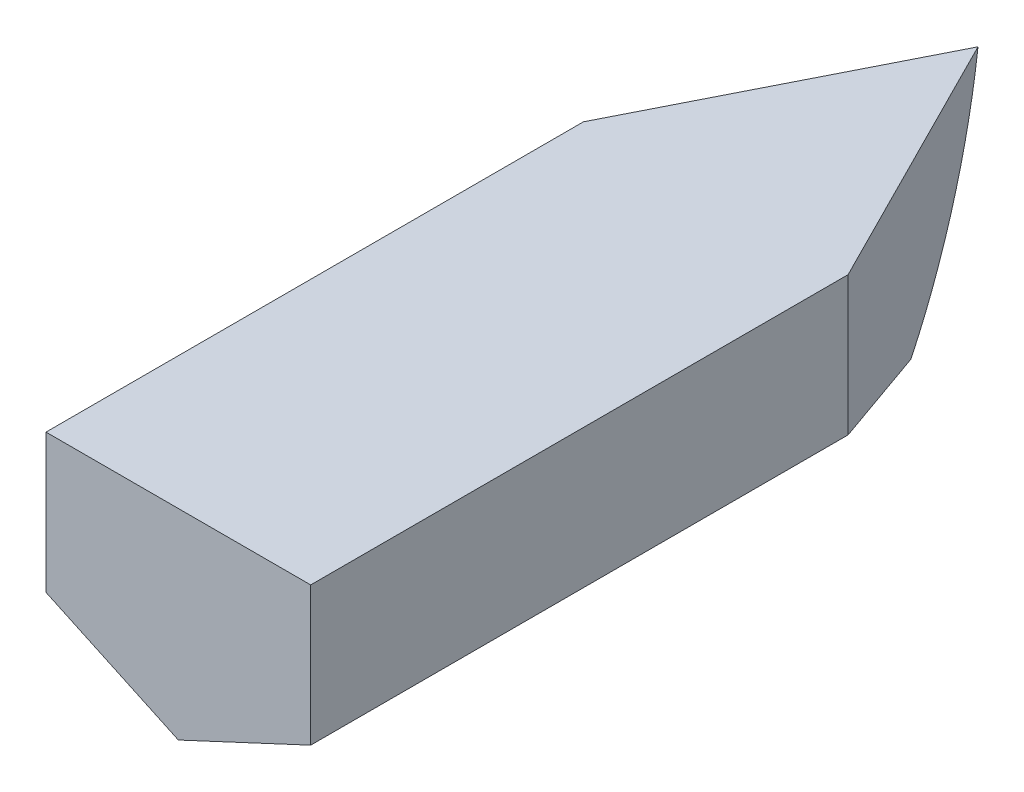
ISO-10303-21;
HEADER;
FILE_DESCRIPTION(('STEP AP214'),'2;1');
FILE_NAME('part.step','',(''),(''),'','','');
FILE_SCHEMA(('AUTOMOTIVE_DESIGN { 1 0 10303 214 1 1 1 1 }'));
ENDSEC;
DATA;
#1=APPLICATION_CONTEXT('core data for automotive mechanical design processes');
#2=APPLICATION_PROTOCOL_DEFINITION('international standard','automotive_design',2000,#1);
#3=PRODUCT_CONTEXT('',#1,'mechanical');
#4=PRODUCT('Part','Part','',(#3));
#5=PRODUCT_RELATED_PRODUCT_CATEGORY('part','',(#4));
#6=PRODUCT_DEFINITION_FORMATION('','',#4);
#7=PRODUCT_DEFINITION_CONTEXT('part definition',#1,'design');
#8=PRODUCT_DEFINITION('design','',#6,#7);
#9=PRODUCT_DEFINITION_SHAPE('','',#8);
#10=(LENGTH_UNIT() NAMED_UNIT(*) SI_UNIT(.MILLI.,.METRE.));
#11=(NAMED_UNIT(*) PLANE_ANGLE_UNIT() SI_UNIT($,.RADIAN.));
#12=(NAMED_UNIT(*) SI_UNIT($,.STERADIAN.) SOLID_ANGLE_UNIT());
#13=UNCERTAINTY_MEASURE_WITH_UNIT(LENGTH_MEASURE(1.E-05),#10,'distance_accuracy_value','');
#14=(GEOMETRIC_REPRESENTATION_CONTEXT(3) GLOBAL_UNCERTAINTY_ASSIGNED_CONTEXT((#13)) GLOBAL_UNIT_ASSIGNED_CONTEXT((#10,
#11,#12)) REPRESENTATION_CONTEXT('',''));
#15=CARTESIAN_POINT('',(0.,0.,0.));
#16=DIRECTION('',(0.,0.,1.));
#17=DIRECTION('',(1.,0.,0.));
#18=AXIS2_PLACEMENT_3D('',#15,#16,#17);
#19=CARTESIAN_POINT('',(0.000236309728793086,-63.0481658964329,-282.275632457786));
#20=DIRECTION('',(-0.892749487223846,0.,-0.450553385362446));
#21=DIRECTION('',(-0.450553385362446,0.,0.892749487223846));
#22=AXIS2_PLACEMENT_3D('',#19,#20,#21);
#23=PLANE('',#22);
#24=DIRECTION('',(-0.440927086659275,0.205607677197189,0.873675447364604));
#25=VECTOR('',#24,1.);
#26=CARTESIAN_POINT('',(-5.51209118767557,-60.4771721556966,-271.353225243469));
#27=LINE('',#26,#25);
#28=CARTESIAN_POINT('',(-38.7653446429146,-44.9709254109497,-205.463530625355));
#29=VERTEX_POINT('',#28);
#30=CARTESIAN_POINT('',(-75.0561484010946,-28.0482456979105,-133.555078711286));
#31=VERTEX_POINT('',#30);
#32=EDGE_CURVE('E150',#29,#31,#27,.T.);
#33=ORIENTED_EDGE('',*,*,#32,.T.);
#34=DIRECTION('',(0.,1.,0.));
#35=VECTOR('',#34,1.);
#36=CARTESIAN_POINT('',(-75.0561484010946,-28.0482456979104,-133.555078711286));
#37=LINE('',#36,#35);
#38=CARTESIAN_POINT('',(-75.0561484010946,50.6719145599895,-133.555078711286));
#39=VERTEX_POINT('',#38);
#40=EDGE_CURVE('E225',#31,#39,#37,.T.);
#41=ORIENTED_EDGE('',*,*,#40,.T.);
#42=DIRECTION('',(-0.450553385362446,0.,0.892749487223846));
#43=VECTOR('',#42,1.);
#44=CARTESIAN_POINT('',(0.000236309728782573,50.6719145599895,-282.275632457786));
#45=LINE('',#44,#43);
#46=CARTESIAN_POINT('',(0.000236309728793086,50.6719145599895,-282.275632457786));
#47=VERTEX_POINT('',#46);
#48=EDGE_CURVE('E457',#47,#39,#45,.T.);
#49=ORIENTED_EDGE('',*,*,#48,.F.);
#50=CARTESIAN_POINT('',(-75.4432099621159,92.0615570355149,-132.788135167297));
#51=DIRECTION('',(-0.892749487223846,0.,-0.450553385362446));
#52=DIRECTION('',(0.450553385362446,0.,-0.892749487223846));
#53=AXIS2_PLACEMENT_3D('',#50,#51,#52);
#54=ELLIPSE('',#53,173.745962585296,155.111619005237);
#55=EDGE_CURVE('E525',#47,#29,#54,.T.);
#56=ORIENTED_EDGE('',*,*,#55,.T.);
#57=EDGE_LOOP('',(#33,#41,#49,#56));
#58=FACE_BOUND('',#57,.T.);
#59=ADVANCED_FACE('F67',(#58),#23,.T.);
#60=CARTESIAN_POINT('',(75.0589937649358,-63.0481658964329,-133.555078711286));
#61=DIRECTION('',(0.892743758101189,0.,-0.45056473715923));
#62=DIRECTION('',(-0.45056473715923,0.,-0.892743758101189));
#63=AXIS2_PLACEMENT_3D('',#60,#61,#62);
#64=PLANE('',#63);
#65=DIRECTION('',(-0.440937726263639,-0.205612638526184,-0.873668910077355));
#66=VECTOR('',#65,1.);
#67=CARTESIAN_POINT('',(5.512930172541,-60.478107745578,-271.352844608525));
#68=LINE('',#67,#66);
#69=CARTESIAN_POINT('',(75.0589937649358,-28.0482456979105,-133.555078711286));
#70=VERTEX_POINT('',#69);
#71=CARTESIAN_POINT('',(38.7673953732541,-44.9712959546369,-205.462831945509));
#72=VERTEX_POINT('',#71);
#73=EDGE_CURVE('E194',#70,#72,#68,.T.);
#74=ORIENTED_EDGE('',*,*,#73,.T.);
#75=CARTESIAN_POINT('',(75.4460675620665,92.0615570355149,-132.788135167297));
#76=DIRECTION('',(0.892743758101189,0.,-0.45056473715923));
#77=DIRECTION('',(0.45056473715923,0.,0.892743758101189));
#78=AXIS2_PLACEMENT_3D('',#75,#76,#77);
#79=ELLIPSE('',#78,173.747077588254,155.111619005237);
#80=EDGE_CURVE('E572',#72,#47,#79,.T.);
#81=ORIENTED_EDGE('',*,*,#80,.T.);
#82=DIRECTION('',(-0.45056473715923,0.,-0.892743758101189));
#83=VECTOR('',#82,1.);
#84=CARTESIAN_POINT('',(75.0589937649358,50.6719145599895,-133.555078711286));
#85=LINE('',#84,#83);
#86=CARTESIAN_POINT('',(75.0589937649358,50.6719145599895,-133.555078711286));
#87=VERTEX_POINT('',#86);
#88=EDGE_CURVE('E224',#87,#47,#85,.T.);
#89=ORIENTED_EDGE('',*,*,#88,.F.);
#90=DIRECTION('',(0.,-1.,0.));
#91=VECTOR('',#90,1.);
#92=CARTESIAN_POINT('',(75.0589937649358,-28.0482456979105,-133.555078711286));
#93=LINE('',#92,#91);
#94=EDGE_CURVE('E158',#87,#70,#93,.T.);
#95=ORIENTED_EDGE('',*,*,#94,.T.);
#96=EDGE_LOOP('',(#74,#81,#89,#95));
#97=FACE_BOUND('',#96,.T.);
#98=ADVANCED_FACE('F222',(#97),#64,.T.);
#99=CARTESIAN_POINT('',(0.000236309728793086,-2.23535593892466,171.244921288715));
#100=DIRECTION('',(0.,0.,-1.));
#101=DIRECTION('',(-1.,0.,0.));
#102=AXIS2_PLACEMENT_3D('',#99,#100,#101);
#103=PLANE('',#102);
#104=DIRECTION('',(0.906307787036653,-0.422618261740694,0.));
#105=VECTOR('',#104,1.);
#106=CARTESIAN_POINT('',(-0.000950062462979703,-63.048165896433,171.244921288715));
#107=LINE('',#106,#105);
#108=CARTESIAN_POINT('',(-75.0585211454782,-28.0482456979105,171.244921288715));
#109=VERTEX_POINT('',#108);
#110=CARTESIAN_POINT('',(-0.000950062462979703,-63.048165896433,171.244921288715));
#111=VERTEX_POINT('',#110);
#112=EDGE_CURVE('E287',#109,#111,#107,.T.);
#113=ORIENTED_EDGE('',*,*,#112,.T.);
#114=DIRECTION('',(0.906307787036653,0.422618261740694,0.));
#115=VECTOR('',#114,1.);
#116=CARTESIAN_POINT('',(-0.000950062462979703,-63.048165896433,171.244921288715));
#117=LINE('',#116,#115);
#118=CARTESIAN_POINT('',(75.0566210205522,-28.0482456979104,171.244921288715));
#119=VERTEX_POINT('',#118);
#120=EDGE_CURVE('E458',#111,#119,#117,.T.);
#121=ORIENTED_EDGE('',*,*,#120,.T.);
#122=DIRECTION('',(0.,1.,0.));
#123=VECTOR('',#122,1.);
#124=CARTESIAN_POINT('',(75.0566210205522,-28.0482456979104,171.244921288715));
#125=LINE('',#124,#123);
#126=CARTESIAN_POINT('',(75.0566210205522,50.6719145599895,171.244921288715));
#127=VERTEX_POINT('',#126);
#128=EDGE_CURVE('E216',#119,#127,#125,.T.);
#129=ORIENTED_EDGE('',*,*,#128,.T.);
#130=DIRECTION('',(-1.,0.,0.));
#131=VECTOR('',#130,1.);
#132=CARTESIAN_POINT('',(75.0566210205522,50.6719145599895,171.244921288715));
#133=LINE('',#132,#131);
#134=CARTESIAN_POINT('',(-75.0585211454782,50.6719145599895,171.244921288715));
#135=VERTEX_POINT('',#134);
#136=EDGE_CURVE('E438',#127,#135,#133,.T.);
#137=ORIENTED_EDGE('',*,*,#136,.T.);
#138=DIRECTION('',(0.,-1.,0.));
#139=VECTOR('',#138,1.);
#140=CARTESIAN_POINT('',(-75.0585211454782,-28.0482456979105,171.244921288715));
#141=LINE('',#140,#139);
#142=EDGE_CURVE('E436',#135,#109,#141,.T.);
#143=ORIENTED_EDGE('',*,*,#142,.T.);
#144=EDGE_LOOP('',(#113,#121,#129,#137,#143));
#145=FACE_BOUND('',#144,.T.);
#146=ADVANCED_FACE('F245',(#145),#103,.F.);
#147=CARTESIAN_POINT('',(-75.0585211454782,50.6719145599895,171.244921288715));
#148=DIRECTION('',(0.,1.,0.));
#149=DIRECTION('',(1.,0.,0.));
#150=AXIS2_PLACEMENT_3D('',#147,#148,#149);
#151=PLANE('',#150);
#152=ORIENTED_EDGE('',*,*,#136,.F.);
#153=CARTESIAN_POINT('',(75.0566210205522,50.6719145599895,171.244921288715));
#154=CARTESIAN_POINT('',(75.056225563155,50.6719145599895,120.44492128556));
#155=CARTESIAN_POINT('',(75.056225563155,50.6719145599895,18.8449212794033));
#156=CARTESIAN_POINT('',(75.057807392744,50.6719145599895,-82.7550787144398));
#157=CARTESIAN_POINT('',(75.0589937649358,50.6719145599895,-133.555078711286));
#158=B_SPLINE_CURVE_WITH_KNOTS('',3,(#153,#154,#155,#156,#157),.UNSPECIFIED.,.F.,.F.,(4,1,4),
(0.,0.499999999970446,1.),.UNSPECIFIED.);
#159=EDGE_CURVE('E218',#127,#87,#158,.T.);
#160=ORIENTED_EDGE('',*,*,#159,.T.);
#161=ORIENTED_EDGE('',*,*,#88,.T.);
#162=ORIENTED_EDGE('',*,*,#48,.T.);
#163=CARTESIAN_POINT('',(-75.0585211454782,50.6719145599895,171.244921288715));
#164=CARTESIAN_POINT('',(-75.0589166028754,50.6719145599895,120.44492128556));
#165=CARTESIAN_POINT('',(-75.0589166028754,50.6719145599895,18.8449212794033));
#166=CARTESIAN_POINT('',(-75.0573347732864,50.6719145599895,-82.7550787144398));
#167=CARTESIAN_POINT('',(-75.0561484010946,50.6719145599895,-133.555078711286));
#168=B_SPLINE_CURVE_WITH_KNOTS('',3,(#163,#164,#165,#166,#167),.UNSPECIFIED.,.F.,.F.,(4,1,4),
(0.,0.499999999970446,1.),.UNSPECIFIED.);
#169=EDGE_CURVE('E451',#39,#135,#168,.F.);
#170=ORIENTED_EDGE('',*,*,#169,.T.);
#171=EDGE_LOOP('',(#152,#160,#161,#162,#170));
#172=FACE_BOUND('',#171,.T.);
#173=ADVANCED_FACE('F251',(#172),#151,.T.);
#174=CARTESIAN_POINT('',(75.0566210205522,50.6719145599895,171.244921288715));
#175=CARTESIAN_POINT('',(75.056225563155,50.6719145599895,120.44492128556));
#176=CARTESIAN_POINT('',(75.056225563155,50.6719145599895,18.8449212794033));
#177=CARTESIAN_POINT('',(75.057807392744,50.6719145599895,-82.7550787144398));
#178=CARTESIAN_POINT('',(75.0589937649358,50.6719145599895,-133.555078711286));
#179=CARTESIAN_POINT('',(75.0566210205522,24.4318611406895,171.244921288715));
#180=CARTESIAN_POINT('',(75.056225563155,24.4318611406895,120.44492128556));
#181=CARTESIAN_POINT('',(75.056225563155,24.4318611406895,18.8449212794033));
#182=CARTESIAN_POINT('',(75.057807392744,24.4318611406895,-82.7550787144398));
#183=CARTESIAN_POINT('',(75.0589937649358,24.4318611406895,-133.555078711286));
#184=CARTESIAN_POINT('',(75.0566210205522,-1.80819227861045,171.244921288715));
#185=CARTESIAN_POINT('',(75.056225563155,-1.80819227861045,120.44492128556));
#186=CARTESIAN_POINT('',(75.056225563155,-1.80819227861045,18.8449212794033));
#187=CARTESIAN_POINT('',(75.057807392744,-1.80819227861046,-82.7550787144398));
#188=CARTESIAN_POINT('',(75.0589937649358,-1.80819227861047,-133.555078711286));
#189=CARTESIAN_POINT('',(75.0566210205522,-28.0482456979104,171.244921288715));
#190=CARTESIAN_POINT('',(75.056225563155,-28.0482456979104,120.44492128556));
#191=CARTESIAN_POINT('',(75.056225563155,-28.0482456979104,18.8449212794033));
#192=CARTESIAN_POINT('',(75.057807392744,-28.0482456979104,-82.7550787144398));
#193=CARTESIAN_POINT('',(75.0589937649358,-28.0482456979105,-133.555078711286));
#194=B_SPLINE_SURFACE_WITH_KNOTS('',3,3,((#174,#175,#176,#177,#178),(#179,#180,#181,#182,#183),
(#184,#185,#186,#187,#188),(#189,#190,#191,#192,#193)),.UNSPECIFIED.,.F.,.F.,.F.,(4,4),(4,1,4),
(0.,1.),(0.,0.499999999970446,1.),.UNSPECIFIED.);
#195=CARTESIAN_POINT('',(75.0566210205522,-28.0482456979104,171.244921288715));
#196=CARTESIAN_POINT('',(75.056225563155,-28.0482456979104,120.44492128556));
#197=CARTESIAN_POINT('',(75.056225563155,-28.0482456979104,18.8449212794033));
#198=CARTESIAN_POINT('',(75.057807392744,-28.0482456979104,-82.7550787144398));
#199=CARTESIAN_POINT('',(75.0589937649358,-28.0482456979105,-133.555078711286));
#200=B_SPLINE_CURVE_WITH_KNOTS('',3,(#195,#196,#197,#198,#199),.UNSPECIFIED.,.F.,.F.,(4,1,4),
(0.,0.499999999970446,1.),.UNSPECIFIED.);
#201=EDGE_CURVE('E209',#119,#70,#200,.T.);
#202=ORIENTED_EDGE('',*,*,#128,.F.);
#203=ORIENTED_EDGE('',*,*,#201,.T.);
#204=ORIENTED_EDGE('',*,*,#94,.F.);
#205=ORIENTED_EDGE('',*,*,#159,.F.);
#206=EDGE_LOOP('',(#202,#203,#204,#205));
#207=FACE_BOUND('',#206,.T.);
#208=ADVANCED_FACE('F215',(#207),#194,.T.);
#209=CARTESIAN_POINT('',(-75.0585211454782,-28.0482456979105,171.244921288715));
#210=CARTESIAN_POINT('',(-75.0589166028754,-28.0482456979105,120.44492128556));
#211=CARTESIAN_POINT('',(-75.0589166028754,-28.0482456979105,18.8449212794033));
#212=CARTESIAN_POINT('',(-75.0573347732864,-28.0482456979104,-82.7550787144398));
#213=CARTESIAN_POINT('',(-75.0561484010946,-28.0482456979104,-133.555078711286));
#214=CARTESIAN_POINT('',(-75.0585211454782,-1.80819227861047,171.244921288715));
#215=CARTESIAN_POINT('',(-75.0589166028754,-1.80819227861047,120.44492128556));
#216=CARTESIAN_POINT('',(-75.0589166028754,-1.80819227861047,18.8449212794033));
#217=CARTESIAN_POINT('',(-75.0573347732864,-1.80819227861046,-82.7550787144398));
#218=CARTESIAN_POINT('',(-75.0561484010946,-1.80819227861045,-133.555078711286));
#219=CARTESIAN_POINT('',(-75.0585211454782,24.4318611406895,171.244921288715));
#220=CARTESIAN_POINT('',(-75.0589166028754,24.4318611406895,120.44492128556));
#221=CARTESIAN_POINT('',(-75.0589166028754,24.4318611406895,18.8449212794033));
#222=CARTESIAN_POINT('',(-75.0573347732864,24.4318611406895,-82.7550787144398));
#223=CARTESIAN_POINT('',(-75.0561484010946,24.4318611406895,-133.555078711286));
#224=CARTESIAN_POINT('',(-75.0585211454782,50.6719145599895,171.244921288715));
#225=CARTESIAN_POINT('',(-75.0589166028754,50.6719145599895,120.44492128556));
#226=CARTESIAN_POINT('',(-75.0589166028754,50.6719145599895,18.8449212794033));
#227=CARTESIAN_POINT('',(-75.0573347732864,50.6719145599895,-82.7550787144398));
#228=CARTESIAN_POINT('',(-75.0561484010946,50.6719145599895,-133.555078711286));
#229=B_SPLINE_SURFACE_WITH_KNOTS('',3,3,((#209,#210,#211,#212,#213),(#214,#215,#216,#217,#218),
(#219,#220,#221,#222,#223),(#224,#225,#226,#227,#228)),.UNSPECIFIED.,.F.,.F.,.F.,(4,4),(4,1,4),
(0.,1.),(0.,0.499999999970446,1.),.UNSPECIFIED.);
#230=CARTESIAN_POINT('',(-75.0585211454782,-28.0482456979105,171.244921288715));
#231=CARTESIAN_POINT('',(-75.0589166028754,-28.0482456979105,120.44492128556));
#232=CARTESIAN_POINT('',(-75.0589166028753,-28.0482456979105,18.8449212794033));
#233=CARTESIAN_POINT('',(-75.0573347732863,-28.0482456979104,-82.7550787144398));
#234=CARTESIAN_POINT('',(-75.0561484010946,-28.0482456979104,-133.555078711286));
#235=B_SPLINE_CURVE_WITH_KNOTS('',3,(#230,#231,#232,#233,#234),.UNSPECIFIED.,.F.,.F.,(4,1,4),
(0.,0.499999999970446,1.),.UNSPECIFIED.);
#236=EDGE_CURVE('E212',#109,#31,#235,.T.);
#237=ORIENTED_EDGE('',*,*,#142,.F.);
#238=ORIENTED_EDGE('',*,*,#169,.F.);
#239=ORIENTED_EDGE('',*,*,#40,.F.);
#240=ORIENTED_EDGE('',*,*,#236,.F.);
#241=EDGE_LOOP('',(#237,#238,#239,#240));
#242=FACE_BOUND('',#241,.T.);
#243=ADVANCED_FACE('F326',(#242),#229,.T.);
#244=CARTESIAN_POINT('',(75.0566210205522,-28.0482456979104,171.244921288715));
#245=CARTESIAN_POINT('',(75.056225563155,-28.0482456979104,120.44492128556));
#246=CARTESIAN_POINT('',(75.056225563155,-28.0482456979104,18.8449212794033));
#247=CARTESIAN_POINT('',(75.057807392744,-28.0482456979105,-82.7550787144398));
#248=CARTESIAN_POINT('',(75.0589937649357,-28.0482456979105,-133.555078711286));
#249=CARTESIAN_POINT('',(50.0374306595471,-39.7148857640846,171.244921288715));
#250=CARTESIAN_POINT('',(50.0370352021499,-39.7148857640846,120.44492128556));
#251=CARTESIAN_POINT('',(50.03703520215,-39.7148857640846,18.8449212794033));
#252=CARTESIAN_POINT('',(50.0386170317389,-39.7148857640846,-82.7550787144398));
#253=CARTESIAN_POINT('',(50.0398034039307,-39.7148857640846,-133.555078711286));
#254=CARTESIAN_POINT('',(25.0182402985421,-51.3815258302588,171.244921288715));
#255=CARTESIAN_POINT('',(25.0178448411448,-51.3815258302588,120.44492128556));
#256=CARTESIAN_POINT('',(25.0178448411449,-51.3815258302588,18.8449212794033));
#257=CARTESIAN_POINT('',(25.0194266707339,-51.3815258302588,-82.7550787144398));
#258=CARTESIAN_POINT('',(25.0206130429256,-51.3815258302588,-133.555078711286));
#259=CARTESIAN_POINT('',(-0.000950062462979703,-63.048165896433,171.244921288715));
#260=CARTESIAN_POINT('',(-0.00134551986021392,-63.048165896433,120.44492128556));
#261=CARTESIAN_POINT('',(-0.00134551986016717,-63.048165896433,18.8449212794033));
#262=CARTESIAN_POINT('',(0.00023630972881646,-63.048165896433,-82.7550787144398));
#263=CARTESIAN_POINT('',(0.00142268192056587,-63.048165896433,-133.555078711286));
#264=B_SPLINE_SURFACE_WITH_KNOTS('',3,3,((#244,#245,#246,#247,#248),(#249,#250,#251,#252,#253),
(#254,#255,#256,#257,#258),(#259,#260,#261,#262,#263)),.UNSPECIFIED.,.F.,.F.,.F.,(4,4),(4,1,4),
(0.,1.),(0.,0.499999999970446,1.),.UNSPECIFIED.);
#265=CARTESIAN_POINT('',(-0.000950062462979703,-63.048165896433,171.244921288715));
#266=CARTESIAN_POINT('',(-0.00134551986021392,-63.048165896433,120.44492128556));
#267=CARTESIAN_POINT('',(-0.00134551986016717,-63.048165896433,18.8449212794033));
#268=CARTESIAN_POINT('',(0.00023630972881646,-63.048165896433,-82.7550787144398));
#269=CARTESIAN_POINT('',(0.00142268192056587,-63.048165896433,-133.555078711286));
#270=B_SPLINE_CURVE_WITH_KNOTS('',3,(#265,#266,#267,#268,#269),.UNSPECIFIED.,.F.,.F.,(4,1,4),
(0.,0.499999999970446,1.),.UNSPECIFIED.);
#271=CARTESIAN_POINT('',(0.00142268192056726,-63.048165896433,-133.555078711286));
#272=VERTEX_POINT('',#271);
#273=EDGE_CURVE('E210',#111,#272,#270,.T.);
#274=DIRECTION('',(-0.906307787036653,-0.422618261740694,0.));
#275=VECTOR('',#274,1.);
#276=CARTESIAN_POINT('',(0.00142268192056587,-63.048165896433,-133.555078711286));
#277=LINE('',#276,#275);
#278=EDGE_CURVE('E197',#70,#272,#277,.T.);
#279=ORIENTED_EDGE('',*,*,#120,.F.);
#280=ORIENTED_EDGE('',*,*,#273,.T.);
#281=ORIENTED_EDGE('',*,*,#278,.F.);
#282=ORIENTED_EDGE('',*,*,#201,.F.);
#283=EDGE_LOOP('',(#279,#280,#281,#282));
#284=FACE_BOUND('',#283,.T.);
#285=ADVANCED_FACE('F208',(#284),#264,.T.);
#286=CARTESIAN_POINT('',(-0.000950062462979703,-63.048165896433,171.244921288715));
#287=CARTESIAN_POINT('',(-0.00134551986021392,-63.048165896433,120.44492128556));
#288=CARTESIAN_POINT('',(-0.00134551986016717,-63.048165896433,18.8449212794033));
#289=CARTESIAN_POINT('',(0.00023630972881646,-63.048165896433,-82.7550787144398));
#290=CARTESIAN_POINT('',(0.00142268192056587,-63.048165896433,-133.555078711286));
#291=CARTESIAN_POINT('',(0.00144640936439946,-63.048165896433,-134.571078711162));
#292=CARTESIAN_POINT('',(0.00147013680823305,-63.048165896433,-135.587078711039));
#293=CARTESIAN_POINT('',(0.00149386425206663,-63.048165896433,-136.603078710916));
#294=CARTESIAN_POINT('',(-25.020140423468,-51.3815258302588,171.244921288715));
#295=CARTESIAN_POINT('',(-25.0205358808653,-51.3815258302588,120.44492128556));
#296=CARTESIAN_POINT('',(-25.0205358808652,-51.3815258302588,18.8449212794033));
#297=CARTESIAN_POINT('',(-25.0189540512762,-51.3815258302588,-82.7550787144398));
#298=CARTESIAN_POINT('',(-25.0177676790845,-51.3815258302588,-133.555078711286));
#299=CARTESIAN_POINT('',(-25.0177439516407,-51.3815258302588,-134.571078711162));
#300=CARTESIAN_POINT('',(-25.0177202241968,-51.3815258302588,-135.587078711039));
#301=CARTESIAN_POINT('',(-25.017696496753,-51.3815258302588,-136.603078710916));
#302=CARTESIAN_POINT('',(-50.0393307844731,-39.7148857640846,171.244921288715));
#303=CARTESIAN_POINT('',(-50.0397262418703,-39.7148857640847,120.44492128556));
#304=CARTESIAN_POINT('',(-50.0397262418703,-39.7148857640846,18.8449212794033));
#305=CARTESIAN_POINT('',(-50.0381444122813,-39.7148857640846,-82.7550787144398));
#306=CARTESIAN_POINT('',(-50.0369580400896,-39.7148857640846,-133.555078711286));
#307=CARTESIAN_POINT('',(-50.0369343126457,-39.7148857640846,-134.571078711162));
#308=CARTESIAN_POINT('',(-50.0369105852019,-39.7148857640846,-135.587078711039));
#309=CARTESIAN_POINT('',(-50.036886857758,-39.7148857640846,-136.603078710916));
#310=CARTESIAN_POINT('',(-75.0585211454782,-28.0482456979105,171.244921288715));
#311=CARTESIAN_POINT('',(-75.0589166028754,-28.0482456979105,120.44492128556));
#312=CARTESIAN_POINT('',(-75.0589166028753,-28.0482456979105,18.8449212794033));
#313=CARTESIAN_POINT('',(-75.0573347732863,-28.0482456979104,-82.7550787144398));
#314=CARTESIAN_POINT('',(-75.0561484010946,-28.0482456979104,-133.555078711286));
#315=CARTESIAN_POINT('',(-75.0561246736508,-28.0482456979104,-134.571078711162));
#316=CARTESIAN_POINT('',(-75.056100946207,-28.0482456979104,-135.587078711039));
#317=CARTESIAN_POINT('',(-75.0560772187631,-28.0482456979104,-136.603078710916));
#318=B_SPLINE_SURFACE_WITH_KNOTS('',3,3,((#286,#287,#288,#289,#290,#291,#292,#293),(#294,#295,
#296,#297,#298,#299,#300,#301),(#302,#303,#304,#305,#306,#307,#308,#309),(#310,#311,#312,#313,
#314,#315,#316,#317)),.UNSPECIFIED.,.F.,.F.,.F.,(4,4),(4,1,3,4),(0.,1.),(0.,0.499999999970446,
1.,1.01),.UNSPECIFIED.);
#319=DIRECTION('',(-0.906307787036653,0.422618261740694,0.));
#320=VECTOR('',#319,1.);
#321=CARTESIAN_POINT('',(0.00142268192056587,-63.048165896433,-133.555078711286));
#322=LINE('',#321,#320);
#323=EDGE_CURVE('E299',#272,#31,#322,.T.);
#324=ORIENTED_EDGE('',*,*,#112,.F.);
#325=ORIENTED_EDGE('',*,*,#236,.T.);
#326=ORIENTED_EDGE('',*,*,#323,.F.);
#327=ORIENTED_EDGE('',*,*,#273,.F.);
#328=EDGE_LOOP('',(#324,#325,#326,#327));
#329=FACE_BOUND('',#328,.T.);
#330=ADVANCED_FACE('F358',(#329),#318,.T.);
#331=CARTESIAN_POINT('',(-75.0589666028754,92.0615570355149,-132.788135167297));
#332=DIRECTION('',(1.,0.,0.));
#333=DIRECTION('',(0.,0.,-1.));
#334=AXIS2_PLACEMENT_3D('',#331,#332,#333);
#335=CYLINDRICAL_SURFACE('',#334,155.111619005237);
#336=CARTESIAN_POINT('',(332.635296947809,92.0615570355149,-132.788135167297));
#337=DIRECTION('',(-0.422618261740693,0.906307787036653,0.));
#338=DIRECTION('',(0.906307787036653,0.422618261740693,0.));
#339=AXIS2_PLACEMENT_3D('',#336,#337,#338);
#340=ELLIPSE('',#339,367.025358455544,155.111619005237);
#341=EDGE_CURVE('E199',#72,#272,#340,.T.);
#342=ORIENTED_EDGE('',*,*,#341,.T.);
#343=CARTESIAN_POINT('',(-332.632451583968,92.0615570355149,-132.788135167297));
#344=DIRECTION('',(0.422618261740694,0.906307787036653,0.));
#345=DIRECTION('',(0.906307787036653,-0.422618261740694,0.));
#346=AXIS2_PLACEMENT_3D('',#343,#344,#345);
#347=ELLIPSE('',#346,367.025358455543,155.111619005237);
#348=EDGE_CURVE('E202',#272,#29,#347,.T.);
#349=ORIENTED_EDGE('',*,*,#348,.T.);
#350=ORIENTED_EDGE('',*,*,#55,.F.);
#351=ORIENTED_EDGE('',*,*,#80,.F.);
#352=EDGE_LOOP('',(#342,#349,#350,#351));
#353=FACE_BOUND('',#352,.T.);
#354=ADVANCED_FACE('F586',(#353),#335,.T.);
#355=CARTESIAN_POINT('',(-23.2922093660476,-52.1861668862209,-282.277682457786));
#356=DIRECTION('',(0.422618261740694,0.906307787036653,0.));
#357=DIRECTION('',(-0.906307787036653,0.422618261740694,0.));
#358=AXIS2_PLACEMENT_3D('',#355,#356,#357);
#359=PLANE('',#358);
#360=ORIENTED_EDGE('',*,*,#348,.F.);
#361=ORIENTED_EDGE('',*,*,#323,.T.);
#362=ORIENTED_EDGE('',*,*,#32,.F.);
#363=EDGE_LOOP('',(#360,#361,#362));
#364=FACE_BOUND('',#363,.T.);
#365=ADVANCED_FACE('F587',(#364),#359,.F.);
#366=CARTESIAN_POINT('',(23.2931057723516,-52.1870757000459,-282.277682457786));
#367=DIRECTION('',(-0.422618261740693,0.906307787036653,0.));
#368=DIRECTION('',(-0.906307787036653,-0.422618261740693,0.));
#369=AXIS2_PLACEMENT_3D('',#366,#367,#368);
#370=PLANE('',#369);
#371=ORIENTED_EDGE('',*,*,#278,.T.);
#372=ORIENTED_EDGE('',*,*,#341,.F.);
#373=ORIENTED_EDGE('',*,*,#73,.F.);
#374=EDGE_LOOP('',(#371,#372,#373));
#375=FACE_BOUND('',#374,.T.);
#376=ADVANCED_FACE('F196',(#375),#370,.F.);
#377=CLOSED_SHELL('',(#59,#98,#146,#173,#208,#243,#285,#330,#354,#365,#376));
#378=CARTESIAN_POINT('',(2.26782000727736,-63.0481658964329,-281.131226858965));
#379=DIRECTION('',(-0.892749487223846,0.,-0.450553385362446));
#380=DIRECTION('',(-0.450553385362446,0.,0.892749487223846));
#381=AXIS2_PLACEMENT_3D('',#378,#379,#380);
#382=PLANE('',#381);
#383=DIRECTION('',(-0.440927086659275,0.205607677197189,0.873675447364604));
#384=VECTOR('',#383,1.);
#385=CARTESIAN_POINT('',(-3.08629222219515,-58.8057608762798,-270.522315456479));
#386=LINE('',#385,#384);
#387=CARTESIAN_POINT('',(-36.8437503961927,-43.064399609898,-203.633563859211));
#388=VERTEX_POINT('',#387);
#389=CARTESIAN_POINT('',(-72.2110053499364,-26.5723777770473,-133.555078711286));
#390=VERTEX_POINT('',#389);
#391=EDGE_CURVE('E422',#388,#390,#386,.T.);
#392=ORIENTED_EDGE('',*,*,#391,.F.);
#393=CARTESIAN_POINT('',(-72.5980669109577,92.0615570355149,-132.788135167297));
#394=DIRECTION('',(-0.892749487223846,0.,-0.450553385362446));
#395=DIRECTION('',(0.450553385362446,0.,-0.892749487223846));
#396=AXIS2_PLACEMENT_3D('',#393,#394,#395);
#397=ELLIPSE('',#396,170.900819534138,152.571619005237);
#398=CARTESIAN_POINT('',(0.00027215141100434,41.2161034403301,-276.638191735166));
#399=VERTEX_POINT('',#398);
#400=EDGE_CURVE('E781',#399,#388,#397,.T.);
#401=ORIENTED_EDGE('',*,*,#400,.F.);
#402=DIRECTION('',(0.,1.,0.));
#403=VECTOR('',#402,1.);
#404=CARTESIAN_POINT('',(0.00027215141100434,-63.0481658964329,-276.638191735166));
#405=LINE('',#404,#403);
#406=CARTESIAN_POINT('',(0.000272151410962707,48.1319145599895,-276.638191735166));
#407=VERTEX_POINT('',#406);
#408=EDGE_CURVE('E138',#399,#407,#405,.T.);
#409=ORIENTED_EDGE('',*,*,#408,.T.);
#410=DIRECTION('',(-0.450553385362446,0.,0.892749487223846));
#411=VECTOR('',#410,1.);
#412=CARTESIAN_POINT('',(-195.389147749532,48.1319145599895,110.516383266438));
#413=LINE('',#412,#411);
#414=CARTESIAN_POINT('',(-72.5161625026881,48.1319145599895,-132.950424744647));
#415=VERTEX_POINT('',#414);
#416=EDGE_CURVE('E143',#407,#415,#413,.T.);
#417=ORIENTED_EDGE('',*,*,#416,.T.);
#418=DIRECTION('',(0.,1.,0.));
#419=VECTOR('',#418,1.);
#420=CARTESIAN_POINT('',(-72.5161625026881,11.3118344310395,-132.950424744647));
#421=LINE('',#420,#419);
#422=CARTESIAN_POINT('',(-72.5161625026881,-26.4300872356449,-132.950424744647));
#423=VERTEX_POINT('',#422);
#424=EDGE_CURVE('E425',#423,#415,#421,.T.);
#425=ORIENTED_EDGE('',*,*,#424,.F.);
#426=CARTESIAN_POINT('',(-72.211005349924,-26.5723777769165,-133.55507871131));
#427=CARTESIAN_POINT('',(-72.3127244008454,-26.5249475964926,-133.353527389089));
#428=CARTESIAN_POINT('',(-72.4144434517668,-26.4775174160688,-133.151976066868));
#429=CARTESIAN_POINT('',(-72.5161625026882,-26.4300872356449,-132.950424744647));
#430=B_SPLINE_CURVE_WITH_KNOTS('',3,(#426,#427,#428,#429),.UNSPECIFIED.,.F.,.F.,(4,4),(0.,
0.692079406874673),.UNSPECIFIED.);
#431=EDGE_CURVE('E420',#390,#423,#430,.T.);
#432=ORIENTED_EDGE('',*,*,#431,.F.);
#433=EDGE_LOOP('',(#392,#401,#409,#417,#425,#432));
#434=FACE_BOUND('',#433,.T.);
#435=ADVANCED_FACE('F402',(#434),#382,.F.);
#436=CARTESIAN_POINT('',(72.7914246193588,-63.0481658964329,-132.410644278901));
#437=DIRECTION('',(0.892743758101189,0.,-0.45056473715923));
#438=DIRECTION('',(-0.45056473715923,0.,-0.892743758101189));
#439=AXIS2_PLACEMENT_3D('',#436,#437,#438);
#440=PLANE('',#439);
#441=DIRECTION('',(-0.440937726263639,-0.205612638526184,-0.873668910077355));
#442=VECTOR('',#441,1.);
#443=CARTESIAN_POINT('',(3.08713750823972,-58.8066935278732,-270.52191242582));
#444=LINE('',#443,#442);
#445=CARTESIAN_POINT('',(72.2138324552646,-26.5723862911317,-133.555078711286));
#446=VERTEX_POINT('',#445);
#447=CARTESIAN_POINT('',(36.8458114884115,-43.0647653217615,-203.632866319843));
#448=VERTEX_POINT('',#447);
#449=EDGE_CURVE('E727',#446,#448,#444,.T.);
#450=ORIENTED_EDGE('',*,*,#449,.F.);
#451=CARTESIAN_POINT('',(72.2138324552522,-26.572386291001,-133.55507871131));
#452=CARTESIAN_POINT('',(72.3155481911243,-26.5249532725489,-133.353540328895));
#453=CARTESIAN_POINT('',(72.4172639269963,-26.4775202540969,-133.152001946479));
#454=CARTESIAN_POINT('',(72.5189796628684,-26.4300872356449,-132.950463564064));
#455=B_SPLINE_CURVE_WITH_KNOTS('',3,(#451,#452,#453,#454),.UNSPECIFIED.,.F.,.F.,(4,4),(0.,
0.692042856874137),.UNSPECIFIED.);
#456=CARTESIAN_POINT('',(72.5189796628684,-26.4300872356449,-132.950463564064));
#457=VERTEX_POINT('',#456);
#458=EDGE_CURVE('E736',#446,#457,#455,.T.);
#459=ORIENTED_EDGE('',*,*,#458,.T.);
#460=DIRECTION('',(0.,-1.,0.));
#461=VECTOR('',#460,1.);
#462=CARTESIAN_POINT('',(72.5189796628684,11.3118344310395,-132.950463564064));
#463=LINE('',#462,#461);
#464=CARTESIAN_POINT('',(72.5189796628684,48.1319145599896,-132.950463564064));
#465=VERTEX_POINT('',#464);
#466=EDGE_CURVE('E775',#465,#457,#463,.T.);
#467=ORIENTED_EDGE('',*,*,#466,.F.);
#468=DIRECTION('',(-0.45056473715923,0.,-0.892743758101189));
#469=VECTOR('',#468,1.);
#470=CARTESIAN_POINT('',(164.918684256358,48.1319145599895,50.1292422431833));
#471=LINE('',#470,#469);
#472=EDGE_CURVE('E750',#465,#407,#471,.T.);
#473=ORIENTED_EDGE('',*,*,#472,.T.);
#474=ORIENTED_EDGE('',*,*,#408,.F.);
#475=CARTESIAN_POINT('',(72.6009062523954,92.0615570355149,-132.788135167297));
#476=DIRECTION('',(0.892743758101189,0.,-0.45056473715923));
#477=DIRECTION('',(0.45056473715923,0.,0.892743758101189));
#478=AXIS2_PLACEMENT_3D('',#475,#476,#477);
#479=ELLIPSE('',#478,170.901916278583,152.571619005237);
#480=EDGE_CURVE('E778',#448,#399,#479,.T.);
#481=ORIENTED_EDGE('',*,*,#480,.F.);
#482=EDGE_LOOP('',(#450,#459,#467,#473,#474,#481));
#483=FACE_BOUND('',#482,.T.);
#484=ADVANCED_FACE('F404',(#483),#440,.F.);
#485=CARTESIAN_POINT('',(0.000236309728793086,-2.23535593892466,168.704921288715));
#486=DIRECTION('',(0.,0.,-1.));
#487=DIRECTION('',(-1.,0.,0.));
#488=AXIS2_PLACEMENT_3D('',#485,#486,#487);
#489=PLANE('',#488);
#490=DIRECTION('',(-0.906307787036653,0.422618261740694,0.));
#491=VECTOR('',#490,1.);
#492=CARTESIAN_POINT('',(-72.5185405887283,-26.4300872354788,168.704921288715));
#493=LINE('',#492,#491);
#494=CARTESIAN_POINT('',(-72.5185405887283,-26.4300872354788,168.704921288715));
#495=VERTEX_POINT('',#494);
#496=CARTESIAN_POINT('',(-0.000969505784994586,-60.2455859822541,168.704921288715));
#497=VERTEX_POINT('',#496);
#498=EDGE_CURVE('E773',#495,#497,#493,.F.);
#499=ORIENTED_EDGE('',*,*,#498,.F.);
#500=DIRECTION('',(0.,1.,0.));
#501=VECTOR('',#500,1.);
#502=CARTESIAN_POINT('',(-72.5185405887283,48.1319145599895,168.704921288715));
#503=LINE('',#502,#501);
#504=CARTESIAN_POINT('',(-72.5185405887283,48.1319145599895,168.704921288715));
#505=VERTEX_POINT('',#504);
#506=EDGE_CURVE('E765',#505,#495,#503,.F.);
#507=ORIENTED_EDGE('',*,*,#506,.F.);
#508=DIRECTION('',(-1.,0.,0.));
#509=VECTOR('',#508,1.);
#510=CARTESIAN_POINT('',(-75.0585211454782,48.1319145599895,168.704921288715));
#511=LINE('',#510,#509);
#512=CARTESIAN_POINT('',(72.5166015771583,48.1319145599895,168.704921288715));
#513=VERTEX_POINT('',#512);
#514=EDGE_CURVE('E767',#513,#505,#511,.T.);
#515=ORIENTED_EDGE('',*,*,#514,.F.);
#516=DIRECTION('',(0.,-1.,0.));
#517=VECTOR('',#516,1.);
#518=CARTESIAN_POINT('',(72.5166015771583,-26.4300872354787,168.704921288715));
#519=LINE('',#518,#517);
#520=CARTESIAN_POINT('',(72.5166015771583,-26.4300872354787,168.704921288715));
#521=VERTEX_POINT('',#520);
#522=EDGE_CURVE('E769',#521,#513,#519,.F.);
#523=ORIENTED_EDGE('',*,*,#522,.F.);
#524=DIRECTION('',(-0.906307787036653,-0.422618261740694,0.));
#525=VECTOR('',#524,1.);
#526=CARTESIAN_POINT('',(-0.000969505784996754,-60.2455859822541,168.704921288715));
#527=LINE('',#526,#525);
#528=EDGE_CURVE('E771',#497,#521,#527,.F.);
#529=ORIENTED_EDGE('',*,*,#528,.F.);
#530=EDGE_LOOP('',(#499,#507,#515,#523,#529));
#531=FACE_BOUND('',#530,.T.);
#532=ADVANCED_FACE('F410',(#531),#489,.T.);
#533=CARTESIAN_POINT('',(-75.0585211454782,48.1319145599895,171.244921288715));
#534=DIRECTION('',(0.,1.,0.));
#535=DIRECTION('',(1.,0.,0.));
#536=AXIS2_PLACEMENT_3D('',#533,#534,#535);
#537=PLANE('',#536);
#538=ORIENTED_EDGE('',*,*,#514,.T.);
#539=CARTESIAN_POINT('',(-72.5161625026881,48.1319145599895,-132.950424744647));
#540=CARTESIAN_POINT('',(-72.51677368664,48.1319145599895,-106.710364523212));
#541=CARTESIAN_POINT('',(-72.5172793585453,48.1319145599895,-80.4703042993658));
#542=CARTESIAN_POINT('',(-72.518079678263,48.1319145599895,-27.990183848455));
#543=CARTESIAN_POINT('',(-72.5183743260753,48.1319145599895,-1.75012362139049));
#544=CARTESIAN_POINT('',(-72.5189099576358,48.1319145599895,72.5615981661628));
#545=CARTESIAN_POINT('',(-72.5189023332649,48.1319145599895,120.633259728552));
#546=CARTESIAN_POINT('',(-72.5185405887283,48.1319145599895,168.704921288715));
#547=B_SPLINE_CURVE_WITH_KNOTS('',3,(#539,#540,#541,#542,#543,#544,#545,#546),.UNSPECIFIED.,.F.,
.F.,(4,2,2,4),(0.,78.7201806853538,157.440361370708,301.655346052943),.UNSPECIFIED.);
#548=EDGE_CURVE('E747',#415,#505,#547,.T.);
#549=ORIENTED_EDGE('',*,*,#548,.F.);
#550=ORIENTED_EDGE('',*,*,#416,.F.);
#551=ORIENTED_EDGE('',*,*,#472,.F.);
#552=CARTESIAN_POINT('',(72.5166015771583,48.1319145599895,168.704921288715));
#553=CARTESIAN_POINT('',(72.5164041179236,48.1319145599895,142.464861060905));
#554=CARTESIAN_POINT('',(72.5163121706807,48.1319145599896,116.224800832347));
#555=CARTESIAN_POINT('',(72.5163393001786,48.1319145599895,63.7446803753409));
#556=CARTESIAN_POINT('',(72.5164583769193,48.1319145599895,37.5046201468924));
#557=CARTESIAN_POINT('',(72.5170944112182,48.1319145599895,-36.8071145796752));
#558=CARTESIAN_POINT('',(72.5178599769571,48.1319145599894,-84.8787890757748));
#559=CARTESIAN_POINT('',(72.5189796628684,48.1319145599895,-132.950463564064));
#560=B_SPLINE_CURVE_WITH_KNOTS('',3,(#552,#553,#554,#555,#556,#557,#558,#559),.UNSPECIFIED.,.F.,
.F.,(4,2,2,4),(0.,78.7201806853538,157.440361370708,301.65538487236),.UNSPECIFIED.);
#561=EDGE_CURVE('E759',#513,#465,#560,.T.);
#562=ORIENTED_EDGE('',*,*,#561,.F.);
#563=EDGE_LOOP('',(#538,#549,#550,#551,#562));
#564=FACE_BOUND('',#563,.T.);
#565=ADVANCED_FACE('F671',(#564),#537,.F.);
#566=CARTESIAN_POINT('',(75.0566210205522,50.6719145599895,171.244921288715));
#567=CARTESIAN_POINT('',(75.056225563155,50.6719145599895,120.44492128556));
#568=CARTESIAN_POINT('',(75.056225563155,50.6719145599895,18.8449212794033));
#569=CARTESIAN_POINT('',(75.057807392744,50.6719145599895,-82.7550787144398));
#570=CARTESIAN_POINT('',(75.0589937649358,50.6719145599895,-133.555078711286));
#571=CARTESIAN_POINT('',(75.0566210205522,24.4318611406895,171.244921288715));
#572=CARTESIAN_POINT('',(75.056225563155,24.4318611406895,120.44492128556));
#573=CARTESIAN_POINT('',(75.056225563155,24.4318611406895,18.8449212794033));
#574=CARTESIAN_POINT('',(75.057807392744,24.4318611406895,-82.7550787144398));
#575=CARTESIAN_POINT('',(75.0589937649358,24.4318611406895,-133.555078711286));
#576=CARTESIAN_POINT('',(75.0566210205522,-1.80819227861045,171.244921288715));
#577=CARTESIAN_POINT('',(75.056225563155,-1.80819227861045,120.44492128556));
#578=CARTESIAN_POINT('',(75.056225563155,-1.80819227861045,18.8449212794033));
#579=CARTESIAN_POINT('',(75.057807392744,-1.80819227861046,-82.7550787144398));
#580=CARTESIAN_POINT('',(75.0589937649358,-1.80819227861047,-133.555078711286));
#581=CARTESIAN_POINT('',(75.0566210205522,-28.0482456979104,171.244921288715));
#582=CARTESIAN_POINT('',(75.056225563155,-28.0482456979104,120.44492128556));
#583=CARTESIAN_POINT('',(75.056225563155,-28.0482456979104,18.8449212794033));
#584=CARTESIAN_POINT('',(75.057807392744,-28.0482456979104,-82.7550787144398));
#585=CARTESIAN_POINT('',(75.0589937649358,-28.0482456979105,-133.555078711286));
#586=B_SPLINE_SURFACE_WITH_KNOTS('',3,3,((#566,#567,#568,#569,#570),(#571,#572,#573,#574,#575),
(#576,#577,#578,#579,#580),(#581,#582,#583,#584,#585)),.UNSPECIFIED.,.F.,.F.,.F.,(4,4),(4,1,4),
(0.,1.),(0.,0.499999999970446,1.),.UNSPECIFIED.);
#587=OFFSET_SURFACE('',#586,-2.54,.F.);
#588=ORIENTED_EDGE('',*,*,#522,.T.);
#589=ORIENTED_EDGE('',*,*,#561,.T.);
#590=ORIENTED_EDGE('',*,*,#466,.T.);
#591=CARTESIAN_POINT('',(72.5166602574904,-26.4300872354801,176.285262887282));
#592=CARTESIAN_POINT('',(72.5164433428697,-26.4300872354669,150.045202660082));
#593=CARTESIAN_POINT('',(72.516331399541,-26.4300872354597,123.805142432008));
#594=CARTESIAN_POINT('',(72.5163181043073,-26.4300872354591,71.3250219742209));
#595=CARTESIAN_POINT('',(72.5164167524024,-26.4300872354657,45.0849617445076));
#596=CARTESIAN_POINT('',(72.516825288856,-26.4300872354945,-7.39515871210963));
#597=CARTESIAN_POINT('',(72.5171351772145,-26.4300872355168,-33.6352189390135));
#598=CARTESIAN_POINT('',(72.5179655453553,-26.4300872355733,-86.1153393894881));
#599=CARTESIAN_POINT('',(72.5184860251374,-26.4300872356075,-112.355399613059));
#600=CARTESIAN_POINT('',(72.5191114762116,-26.4300872356459,-138.595459834121));
#601=B_SPLINE_CURVE_WITH_KNOTS('',3,(#591,#592,#593,#594,#595,#596,#597,#598,#599,#600),
.UNSPECIFIED.,.F.,.F.,(4,2,2,2,4),(0.,78.7201806840884,157.440361372938,236.160542058291,
314.88072274364),.UNSPECIFIED.);
#602=EDGE_CURVE('E338',#521,#457,#601,.T.);
#603=ORIENTED_EDGE('',*,*,#602,.F.);
#604=EDGE_LOOP('',(#588,#589,#590,#603));
#605=FACE_BOUND('',#604,.T.);
#606=ADVANCED_FACE('F500',(#605),#587,.F.);
#607=CARTESIAN_POINT('',(-75.0585211454782,-28.0482456979105,171.244921288715));
#608=CARTESIAN_POINT('',(-75.0589166028754,-28.0482456979105,120.44492128556));
#609=CARTESIAN_POINT('',(-75.0589166028754,-28.0482456979105,18.8449212794033));
#610=CARTESIAN_POINT('',(-75.0573347732864,-28.0482456979104,-82.7550787144398));
#611=CARTESIAN_POINT('',(-75.0561484010946,-28.0482456979104,-133.555078711286));
#612=CARTESIAN_POINT('',(-75.0585211454782,-1.80819227861047,171.244921288715));
#613=CARTESIAN_POINT('',(-75.0589166028754,-1.80819227861047,120.44492128556));
#614=CARTESIAN_POINT('',(-75.0589166028754,-1.80819227861047,18.8449212794033));
#615=CARTESIAN_POINT('',(-75.0573347732864,-1.80819227861046,-82.7550787144398));
#616=CARTESIAN_POINT('',(-75.0561484010946,-1.80819227861045,-133.555078711286));
#617=CARTESIAN_POINT('',(-75.0585211454782,24.4318611406895,171.244921288715));
#618=CARTESIAN_POINT('',(-75.0589166028754,24.4318611406895,120.44492128556));
#619=CARTESIAN_POINT('',(-75.0589166028754,24.4318611406895,18.8449212794033));
#620=CARTESIAN_POINT('',(-75.0573347732864,24.4318611406895,-82.7550787144398));
#621=CARTESIAN_POINT('',(-75.0561484010946,24.4318611406895,-133.555078711286));
#622=CARTESIAN_POINT('',(-75.0585211454782,50.6719145599895,171.244921288715));
#623=CARTESIAN_POINT('',(-75.0589166028754,50.6719145599895,120.44492128556));
#624=CARTESIAN_POINT('',(-75.0589166028754,50.6719145599895,18.8449212794033));
#625=CARTESIAN_POINT('',(-75.0573347732864,50.6719145599895,-82.7550787144398));
#626=CARTESIAN_POINT('',(-75.0561484010946,50.6719145599895,-133.555078711286));
#627=B_SPLINE_SURFACE_WITH_KNOTS('',3,3,((#607,#608,#609,#610,#611),(#612,#613,#614,#615,#616),
(#617,#618,#619,#620,#621),(#622,#623,#624,#625,#626)),.UNSPECIFIED.,.F.,.F.,.F.,(4,4),(4,1,4),
(0.,1.),(0.,0.499999999970446,1.),.UNSPECIFIED.);
#628=OFFSET_SURFACE('',#627,-2.54,.F.);
#629=ORIENTED_EDGE('',*,*,#506,.T.);
#630=CARTESIAN_POINT('',(-72.5184819080782,-26.4300872354801,176.285302433021));
#631=CARTESIAN_POINT('',(-72.5186988228903,-26.430087235467,150.045242205822));
#632=CARTESIAN_POINT('',(-72.518810766373,-26.4300872354597,123.805181977748));
#633=CARTESIAN_POINT('',(-72.5188240618187,-26.4300872354591,71.3250615199606));
#634=CARTESIAN_POINT('',(-72.5187254137819,-26.4300872354657,45.0850012902472));
#635=CARTESIAN_POINT('',(-72.5183168773283,-26.4300872354946,-7.39511916636989));
#636=CARTESIAN_POINT('',(-72.5180069889116,-26.4300872355168,-33.6351793932737));
#637=CARTESIAN_POINT('',(-72.5171766205587,-26.4300872355733,-86.1152998437484));
#638=CARTESIAN_POINT('',(-72.5166561406226,-26.4300872356075,-112.355360067319));
#639=CARTESIAN_POINT('',(-72.516030689357,-26.4300872356459,-138.595420288381));
#640=B_SPLINE_CURVE_WITH_KNOTS('',3,(#630,#631,#632,#633,#634,#635,#636,#637,#638,#639),
.UNSPECIFIED.,.F.,.F.,(4,2,2,2,4),(0.,78.7201806840884,157.440361372937,236.160542058291,
314.88072274364),.UNSPECIFIED.);
#641=EDGE_CURVE('E368',#495,#423,#640,.T.);
#642=ORIENTED_EDGE('',*,*,#641,.T.);
#643=ORIENTED_EDGE('',*,*,#424,.T.);
#644=ORIENTED_EDGE('',*,*,#548,.T.);
#645=EDGE_LOOP('',(#629,#642,#643,#644));
#646=FACE_BOUND('',#645,.T.);
#647=ADVANCED_FACE('F324',(#646),#628,.F.);
#648=CARTESIAN_POINT('',(75.0566210205522,-28.0482456979104,171.244921288715));
#649=CARTESIAN_POINT('',(75.056225563155,-28.0482456979104,120.44492128556));
#650=CARTESIAN_POINT('',(75.056225563155,-28.0482456979104,18.8449212794033));
#651=CARTESIAN_POINT('',(75.057807392744,-28.0482456979105,-82.7550787144398));
#652=CARTESIAN_POINT('',(75.0589937649357,-28.0482456979105,-133.555078711286));
#653=CARTESIAN_POINT('',(50.0374306595471,-39.7148857640846,171.244921288715));
#654=CARTESIAN_POINT('',(50.0370352021499,-39.7148857640846,120.44492128556));
#655=CARTESIAN_POINT('',(50.03703520215,-39.7148857640846,18.8449212794033));
#656=CARTESIAN_POINT('',(50.0386170317389,-39.7148857640846,-82.7550787144398));
#657=CARTESIAN_POINT('',(50.0398034039307,-39.7148857640846,-133.555078711286));
#658=CARTESIAN_POINT('',(25.0182402985421,-51.3815258302588,171.244921288715));
#659=CARTESIAN_POINT('',(25.0178448411448,-51.3815258302588,120.44492128556));
#660=CARTESIAN_POINT('',(25.0178448411449,-51.3815258302588,18.8449212794033));
#661=CARTESIAN_POINT('',(25.0194266707339,-51.3815258302588,-82.7550787144398));
#662=CARTESIAN_POINT('',(25.0206130429256,-51.3815258302588,-133.555078711286));
#663=CARTESIAN_POINT('',(-0.000950062462979703,-63.048165896433,171.244921288715));
#664=CARTESIAN_POINT('',(-0.00134551986021392,-63.048165896433,120.44492128556));
#665=CARTESIAN_POINT('',(-0.00134551986016717,-63.048165896433,18.8449212794033));
#666=CARTESIAN_POINT('',(0.00023630972881646,-63.048165896433,-82.7550787144398));
#667=CARTESIAN_POINT('',(0.00142268192056587,-63.048165896433,-133.555078711286));
#668=B_SPLINE_SURFACE_WITH_KNOTS('',3,3,((#648,#649,#650,#651,#652),(#653,#654,#655,#656,#657),
(#658,#659,#660,#661,#662),(#663,#664,#665,#666,#667)),.UNSPECIFIED.,.F.,.F.,.F.,(4,4),(4,1,4),
(0.,1.),(0.,0.499999999970446,1.),.UNSPECIFIED.);
#669=OFFSET_SURFACE('',#668,-2.54,.F.);
#670=ORIENTED_EDGE('',*,*,#528,.T.);
#671=ORIENTED_EDGE('',*,*,#602,.T.);
#672=ORIENTED_EDGE('',*,*,#458,.F.);
#673=CARTESIAN_POINT('',(72.2138324554826,-26.5723862911665,-133.555103780425));
#674=CARTESIAN_POINT('',(69.2049820482294,-27.9754362783114,-133.555103780406));
#675=CARTESIAN_POINT('',(66.1961316409762,-29.3784862654564,-133.555103780401));
#676=CARTESIAN_POINT('',(60.1784308263436,-32.1845862398051,-133.555103780401));
#677=CARTESIAN_POINT('',(57.1695804189642,-33.5876362270089,-133.555103780407));
#678=CARTESIAN_POINT('',(51.1518796043044,-36.3937362013703,-133.555103780419));
#679=CARTESIAN_POINT('',(48.143029197024,-37.7967861885279,-133.555103780424));
#680=CARTESIAN_POINT('',(42.1253283826729,-40.6028861627453,-133.555103780427));
#681=CARTESIAN_POINT('',(39.1164779756022,-42.0059361498052,-133.555103780425));
#682=CARTESIAN_POINT('',(33.0987771613229,-44.8120361239891,-133.555103780426));
#683=CARTESIAN_POINT('',(30.0899267541144,-46.2150861111132,-133.555103780428));
#684=CARTESIAN_POINT('',(24.0722259396818,-49.0211860853687,-133.555103780423));
#685=CARTESIAN_POINT('',(21.0633755324577,-50.4242360725,-133.555103780415));
#686=CARTESIAN_POINT('',(15.0456747180678,-53.2303360467355,-133.555103780411));
#687=CARTESIAN_POINT('',(12.036824310902,-54.6333860338397,-133.555103780416));
#688=CARTESIAN_POINT('',(6.01912349648208,-57.4394860080892,-133.555103780422));
#689=CARTESIAN_POINT('',(3.01027308922801,-58.8425359952346,-133.555103780423));
#690=CARTESIAN_POINT('',(0.00142268197395436,-60.2455859823799,-133.555103780413));
#691=B_SPLINE_CURVE_WITH_KNOTS('',3,(#673,#674,#675,#676,#677,#678,#679,#680,#681,#682,#683,
#684,#685,#686,#687,#688,#689,#690),.UNSPECIFIED.,.F.,.F.,(4,2,2,2,2,2,2,2,4),(0.,
9.95969730247347,19.9193946053647,29.8790919079281,39.8387892097974,49.798486512123,
59.7581838145,69.7178811166842,79.6775784191605),.UNSPECIFIED.);
#692=CARTESIAN_POINT('',(0.00142268184737864,-60.2455859822,-133.555078711286));
#693=VERTEX_POINT('',#692);
#694=EDGE_CURVE('E12',#446,#693,#691,.T.);
#695=ORIENTED_EDGE('',*,*,#694,.T.);
#696=CARTESIAN_POINT('',(-0.000847043075985487,-60.2455859822531,184.478672622506));
#697=CARTESIAN_POINT('',(-0.00109329955000425,-60.2455859822619,156.873047401797));
#698=CARTESIAN_POINT('',(-0.00122650369497194,-60.2455859822676,129.267422180029));
#699=CARTESIAN_POINT('',(-0.00126233444968842,-60.2455859822688,74.0561717346986));
#700=CARTESIAN_POINT('',(-0.00116496105942342,-60.2455859822644,46.450546511136));
#701=CARTESIAN_POINT('',(-0.000735163866536371,-60.2455859822418,-8.76070393298584));
#702=CARTESIAN_POINT('',(-0.000402740063924319,-60.2455859822237,-36.3663291535451));
#703=CARTESIAN_POINT('',(0.000492685076454144,-60.2455859821808,-91.5775795909178));
#704=CARTESIAN_POINT('',(0.00105568641422045,-60.2455859821561,-119.183204807731));
#705=CARTESIAN_POINT('',(0.00173174008096812,-60.2455859821318,-146.788830021726));
#706=B_SPLINE_CURVE_WITH_KNOTS('',3,(#696,#697,#698,#699,#700,#701,#702,#703,#704,#705),
.UNSPECIFIED.,.F.,.F.,(4,2,2,2,4),(0.,82.8168756652697,165.633751335494,248.450627002198,
331.267502668864),.UNSPECIFIED.);
#707=EDGE_CURVE('E352',#497,#693,#706,.T.);
#708=ORIENTED_EDGE('',*,*,#707,.F.);
#709=EDGE_LOOP('',(#670,#671,#672,#695,#708));
#710=FACE_BOUND('',#709,.T.);
#711=ADVANCED_FACE('F313',(#710),#669,.F.);
#712=CARTESIAN_POINT('',(-0.000950062462979703,-63.048165896433,171.244921288715));
#713=CARTESIAN_POINT('',(-0.00134551986021392,-63.048165896433,120.44492128556));
#714=CARTESIAN_POINT('',(-0.00134551986016717,-63.048165896433,18.8449212794033));
#715=CARTESIAN_POINT('',(0.00023630972881646,-63.048165896433,-82.7550787144398));
#716=CARTESIAN_POINT('',(0.00144640936439946,-63.048165896433,-134.571078711162));
#717=CARTESIAN_POINT('',(0.00147013680823305,-63.048165896433,-135.587078711039));
#718=CARTESIAN_POINT('',(0.00149386425206663,-63.048165896433,-136.603078710916));
#719=CARTESIAN_POINT('',(-25.020140423468,-51.3815258302588,171.244921288715));
#720=CARTESIAN_POINT('',(-25.0205358808653,-51.3815258302588,120.44492128556));
#721=CARTESIAN_POINT('',(-25.0205358808652,-51.3815258302588,18.8449212794033));
#722=CARTESIAN_POINT('',(-25.0189540512762,-51.3815258302588,-82.7550787144398));
#723=CARTESIAN_POINT('',(-25.0177439516407,-51.3815258302588,-134.571078711162));
#724=CARTESIAN_POINT('',(-25.0177202241968,-51.3815258302588,-135.587078711039));
#725=CARTESIAN_POINT('',(-25.017696496753,-51.3815258302588,-136.603078710916));
#726=CARTESIAN_POINT('',(-50.0393307844731,-39.7148857640846,171.244921288715));
#727=CARTESIAN_POINT('',(-50.0397262418703,-39.7148857640847,120.44492128556));
#728=CARTESIAN_POINT('',(-50.0397262418703,-39.7148857640846,18.8449212794033));
#729=CARTESIAN_POINT('',(-50.0381444122813,-39.7148857640846,-82.7550787144398));
#730=CARTESIAN_POINT('',(-50.0369343126457,-39.7148857640846,-134.571078711162));
#731=CARTESIAN_POINT('',(-50.0369105852019,-39.7148857640846,-135.587078711039));
#732=CARTESIAN_POINT('',(-50.036886857758,-39.7148857640846,-136.603078710916));
#733=CARTESIAN_POINT('',(-75.0585211454782,-28.0482456979105,171.244921288715));
#734=CARTESIAN_POINT('',(-75.0589166028754,-28.0482456979105,120.44492128556));
#735=CARTESIAN_POINT('',(-75.0589166028753,-28.0482456979105,18.8449212794033));
#736=CARTESIAN_POINT('',(-75.0573347732863,-28.0482456979104,-82.7550787144398));
#737=CARTESIAN_POINT('',(-75.0561246736508,-28.0482456979104,-134.571078711162));
#738=CARTESIAN_POINT('',(-75.056100946207,-28.0482456979104,-135.587078711039));
#739=CARTESIAN_POINT('',(-75.0560772187631,-28.0482456979104,-136.603078710916));
#740=B_SPLINE_SURFACE_WITH_KNOTS('',3,3,((#712,#713,#714,#715,#716,#717,#718),(#719,#720,#721,
#722,#723,#724,#725),(#726,#727,#728,#729,#730,#731,#732),(#733,#734,#735,#736,#737,#738,#739)),
.UNSPECIFIED.,.F.,.F.,.F.,(4,4),(4,1,2,4),(0.,1.),(0.,0.499999999970446,1.,1.01),.UNSPECIFIED.);
#741=OFFSET_SURFACE('',#740,-2.54,.F.);
#742=ORIENTED_EDGE('',*,*,#498,.T.);
#743=ORIENTED_EDGE('',*,*,#707,.T.);
#744=CARTESIAN_POINT('',(0.00142268212330993,-60.2455859824993,-133.555053642166));
#745=CARTESIAN_POINT('',(-3.00742848598325,-58.8425356405627,-133.555053642168));
#746=CARTESIAN_POINT('',(-6.01627965408981,-57.439485298626,-133.555053642168));
#747=CARTESIAN_POINT('',(-12.0339819902776,-54.6333846147644,-133.555053642167));
#748=CARTESIAN_POINT('',(-15.0428331583589,-53.2303342728395,-133.555053642165));
#749=CARTESIAN_POINT('',(-21.0605354944305,-50.4242335890321,-133.555053642163));
#750=CARTESIAN_POINT('',(-24.069386662421,-49.0211832471496,-133.555053642163));
#751=CARTESIAN_POINT('',(-30.0870889983951,-46.2150825633877,-133.555053642165));
#752=CARTESIAN_POINT('',(-33.0959401663787,-44.8120322215083,-133.555053642168));
#753=CARTESIAN_POINT('',(-39.1136425022499,-42.0059315377945,-133.555053642172));
#754=CARTESIAN_POINT('',(-42.1224936701374,-40.6028811959599,-133.555053642173));
#755=CARTESIAN_POINT('',(-48.1401960060017,-37.7967805122492,-133.555053642167));
#756=CARTESIAN_POINT('',(-51.1490471739786,-36.393730170373,-133.55505364216));
#757=CARTESIAN_POINT('',(-57.1667495099439,-33.5876294866152,-133.555053642181));
#758=CARTESIAN_POINT('',(-60.1756006779324,-32.1845791447336,-133.555053642208));
#759=CARTESIAN_POINT('',(-66.1933030139007,-29.3784784609744,-133.55505364223));
#760=CARTESIAN_POINT('',(-69.2021541818805,-27.9754281190968,-133.555053642225));
#761=CARTESIAN_POINT('',(-72.2110053498603,-26.5723777772192,-133.55505364217));
#762=B_SPLINE_CURVE_WITH_KNOTS('',3,(#744,#745,#746,#747,#748,#749,#750,#751,#752,#753,#754,
#755,#756,#757,#758,#759,#760,#761),.UNSPECIFIED.,.F.,.F.,(4,2,2,2,2,2,2,2,4),(0.,
9.95969982099981,19.9193996419158,29.8790994625313,39.8387992831242,49.7984991033989,
59.7581989239694,69.7178987445783,79.6775985651585),.UNSPECIFIED.);
#763=EDGE_CURVE('E79',#693,#390,#762,.T.);
#764=ORIENTED_EDGE('',*,*,#763,.T.);
#765=ORIENTED_EDGE('',*,*,#431,.T.);
#766=ORIENTED_EDGE('',*,*,#641,.F.);
#767=EDGE_LOOP('',(#742,#743,#764,#765,#766));
#768=FACE_BOUND('',#767,.T.);
#769=ADVANCED_FACE('F323',(#768),#741,.F.);
#770=CARTESIAN_POINT('',(-75.0589666028754,92.0615570355149,-132.788135167297));
#771=DIRECTION('',(1.,0.,0.));
#772=DIRECTION('',(0.,0.,-1.));
#773=AXIS2_PLACEMENT_3D('',#770,#771,#772);
#774=CYLINDRICAL_SURFACE('',#773,152.571619005237);
#775=CARTESIAN_POINT('',(326.625144926602,92.0615570355149,-132.788135167297));
#776=DIRECTION('',(-0.422618261740693,0.906307787036653,0.));
#777=DIRECTION('',(0.906307787036653,0.422618261740693,0.));
#778=AXIS2_PLACEMENT_3D('',#775,#776,#777);
#779=ELLIPSE('',#778,361.015206434336,152.571619005237);
#780=CARTESIAN_POINT('',(0.00142268192043771,-60.2455859822682,-141.767729347415));
#781=VERTEX_POINT('',#780);
#782=EDGE_CURVE('E87',#448,#781,#779,.T.);
#783=ORIENTED_EDGE('',*,*,#782,.F.);
#784=ORIENTED_EDGE('',*,*,#480,.T.);
#785=ORIENTED_EDGE('',*,*,#400,.T.);
#786=CARTESIAN_POINT('',(-326.62229956276,92.0615570355149,-132.788135167297));
#787=DIRECTION('',(0.422618261740694,0.906307787036653,0.));
#788=DIRECTION('',(0.906307787036653,-0.422618261740694,0.));
#789=AXIS2_PLACEMENT_3D('',#786,#787,#788);
#790=ELLIPSE('',#789,361.015206434335,152.571619005237);
#791=EDGE_CURVE('E729',#781,#388,#790,.T.);
#792=ORIENTED_EDGE('',*,*,#791,.F.);
#793=EDGE_LOOP('',(#783,#784,#785,#792));
#794=FACE_BOUND('',#793,.T.);
#795=ADVANCED_FACE('F356',(#794),#774,.F.);
#796=CARTESIAN_POINT('',(-22.2187589812263,-49.8841451071478,-282.277682457786));
#797=DIRECTION('',(0.422618261740694,0.906307787036653,0.));
#798=DIRECTION('',(-0.906307787036653,0.422618261740694,0.));
#799=AXIS2_PLACEMENT_3D('',#796,#797,#798);
#800=PLANE('',#799);
#801=ORIENTED_EDGE('',*,*,#791,.T.);
#802=ORIENTED_EDGE('',*,*,#391,.T.);
#803=ORIENTED_EDGE('',*,*,#763,.F.);
#804=DIRECTION('',(0.,0.,1.));
#805=VECTOR('',#804,1.);
#806=CARTESIAN_POINT('',(0.00142268192047587,-60.2455859822683,-282.277682457786));
#807=LINE('',#806,#805);
#808=EDGE_CURVE('E728',#781,#693,#807,.T.);
#809=ORIENTED_EDGE('',*,*,#808,.F.);
#810=EDGE_LOOP('',(#801,#802,#803,#809));
#811=FACE_BOUND('',#810,.T.);
#812=ADVANCED_FACE('F391',(#811),#800,.T.);
#813=CARTESIAN_POINT('',(22.2196553875302,-49.8850539209728,-282.277682457786));
#814=DIRECTION('',(-0.422618261740693,0.906307787036653,0.));
#815=DIRECTION('',(-0.906307787036653,-0.422618261740693,0.));
#816=AXIS2_PLACEMENT_3D('',#813,#814,#815);
#817=PLANE('',#816);
#818=ORIENTED_EDGE('',*,*,#694,.F.);
#819=ORIENTED_EDGE('',*,*,#449,.T.);
#820=ORIENTED_EDGE('',*,*,#782,.T.);
#821=ORIENTED_EDGE('',*,*,#808,.T.);
#822=EDGE_LOOP('',(#818,#819,#820,#821));
#823=FACE_BOUND('',#822,.T.);
#824=ADVANCED_FACE('F69',(#823),#817,.T.);
#825=CLOSED_SHELL('',(#435,#484,#532,#565,#606,#647,#711,#769,#795,#812,#824));
#826=ORIENTED_CLOSED_SHELL('',*,#825,.T.);
#827=BREP_WITH_VOIDS('B2',#377,(#826));
#828=ADVANCED_BREP_SHAPE_REPRESENTATION('',(#18,#827),#14);
#829=SHAPE_DEFINITION_REPRESENTATION(#9,#828);
ENDSEC;
END-ISO-10303-21;
